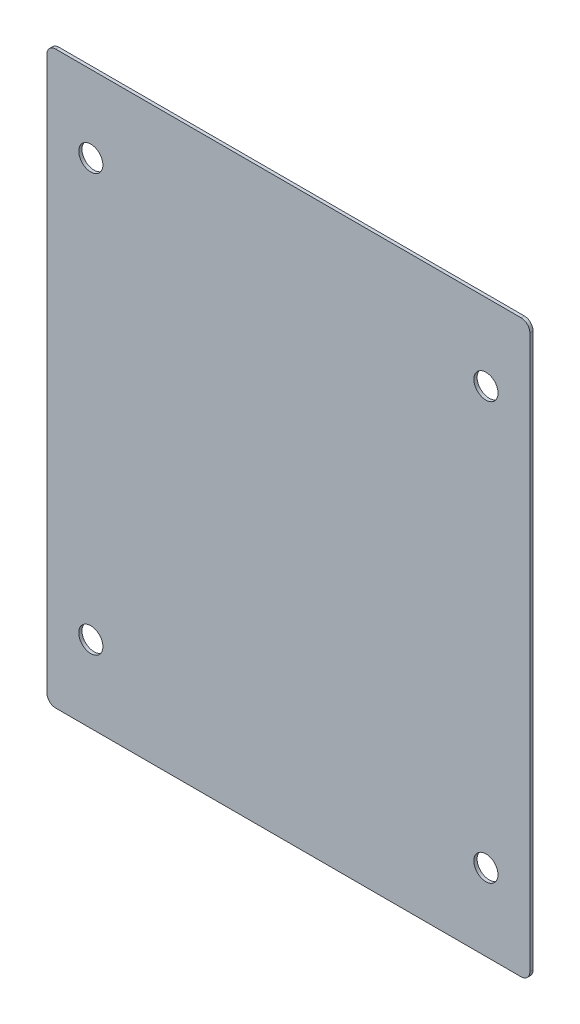
ISO-10303-21;
HEADER;
FILE_DESCRIPTION(('STEP AP214'),'2;1');
FILE_NAME('part.step','',(''),(''),'','','');
FILE_SCHEMA(('AUTOMOTIVE_DESIGN { 1 0 10303 214 1 1 1 1 }'));
ENDSEC;
DATA;
#1=APPLICATION_CONTEXT('core data for automotive mechanical design processes');
#2=APPLICATION_PROTOCOL_DEFINITION('international standard','automotive_design',2000,#1);
#3=PRODUCT_CONTEXT('',#1,'mechanical');
#4=PRODUCT('Part','Part','',(#3));
#5=PRODUCT_RELATED_PRODUCT_CATEGORY('part','',(#4));
#6=PRODUCT_DEFINITION_FORMATION('','',#4);
#7=PRODUCT_DEFINITION_CONTEXT('part definition',#1,'design');
#8=PRODUCT_DEFINITION('design','',#6,#7);
#9=PRODUCT_DEFINITION_SHAPE('','',#8);
#10=(LENGTH_UNIT() NAMED_UNIT(*) SI_UNIT(.MILLI.,.METRE.));
#11=(NAMED_UNIT(*) PLANE_ANGLE_UNIT() SI_UNIT($,.RADIAN.));
#12=(NAMED_UNIT(*) SI_UNIT($,.STERADIAN.) SOLID_ANGLE_UNIT());
#13=UNCERTAINTY_MEASURE_WITH_UNIT(LENGTH_MEASURE(1.E-05),#10,'distance_accuracy_value','');
#14=(GEOMETRIC_REPRESENTATION_CONTEXT(3) GLOBAL_UNCERTAINTY_ASSIGNED_CONTEXT((#13)) GLOBAL_UNIT_ASSIGNED_CONTEXT((#10,
#11,#12)) REPRESENTATION_CONTEXT('',''));
#15=CARTESIAN_POINT('',(0.,0.,0.));
#16=DIRECTION('',(0.,0.,1.));
#17=DIRECTION('',(1.,0.,0.));
#18=AXIS2_PLACEMENT_3D('',#15,#16,#17);
#19=CARTESIAN_POINT('',(-55.,-65.,-0.7366));
#20=DIRECTION('',(-1.,0.,0.));
#21=DIRECTION('',(0.,0.,1.));
#22=AXIS2_PLACEMENT_3D('',#19,#20,#21);
#23=PLANE('',#22);
#24=DIRECTION('',(0.,-1.,0.));
#25=VECTOR('',#24,1.);
#26=CARTESIAN_POINT('',(-55.,-65.,-0.7366));
#27=LINE('',#26,#25);
#28=CARTESIAN_POINT('',(-55.,63.,-0.7366));
#29=VERTEX_POINT('',#28);
#30=CARTESIAN_POINT('',(-55.,-63.,-0.7366));
#31=VERTEX_POINT('',#30);
#32=EDGE_CURVE('E161',#29,#31,#27,.T.);
#33=ORIENTED_EDGE('',*,*,#32,.T.);
#34=DIRECTION('',(0.,0.,1.));
#35=VECTOR('',#34,1.);
#36=CARTESIAN_POINT('',(-55.,-63.,-0.7366));
#37=LINE('',#36,#35);
#38=CARTESIAN_POINT('',(-55.,-63.,0.));
#39=VERTEX_POINT('',#38);
#40=EDGE_CURVE('E154',#31,#39,#37,.T.);
#41=ORIENTED_EDGE('',*,*,#40,.T.);
#42=DIRECTION('',(0.,-1.,0.));
#43=VECTOR('',#42,1.);
#44=CARTESIAN_POINT('',(-55.,-65.,0.));
#45=LINE('',#44,#43);
#46=CARTESIAN_POINT('',(-55.,63.,0.));
#47=VERTEX_POINT('',#46);
#48=EDGE_CURVE('E107',#47,#39,#45,.T.);
#49=ORIENTED_EDGE('',*,*,#48,.F.);
#50=DIRECTION('',(0.,0.,1.));
#51=VECTOR('',#50,1.);
#52=CARTESIAN_POINT('',(-55.,63.,-0.7366));
#53=LINE('',#52,#51);
#54=EDGE_CURVE('E152',#47,#29,#53,.F.);
#55=ORIENTED_EDGE('',*,*,#54,.T.);
#56=EDGE_LOOP('',(#33,#41,#49,#55));
#57=FACE_BOUND('',#56,.T.);
#58=ADVANCED_FACE('F37',(#57),#23,.T.);
#59=CARTESIAN_POINT('',(55.,65.,-0.7366));
#60=DIRECTION('',(0.,1.,0.));
#61=DIRECTION('',(-1.,0.,0.));
#62=AXIS2_PLACEMENT_3D('',#59,#60,#61);
#63=PLANE('',#62);
#64=DIRECTION('',(-1.,0.,0.));
#65=VECTOR('',#64,1.);
#66=CARTESIAN_POINT('',(55.,65.,0.));
#67=LINE('',#66,#65);
#68=CARTESIAN_POINT('',(53.,65.,0.));
#69=VERTEX_POINT('',#68);
#70=CARTESIAN_POINT('',(-53.,65.,0.));
#71=VERTEX_POINT('',#70);
#72=EDGE_CURVE('E135',#69,#71,#67,.T.);
#73=ORIENTED_EDGE('',*,*,#72,.F.);
#74=DIRECTION('',(0.,0.,1.));
#75=VECTOR('',#74,1.);
#76=CARTESIAN_POINT('',(53.,65.,-0.7366));
#77=LINE('',#76,#75);
#78=CARTESIAN_POINT('',(53.,65.,-0.7366));
#79=VERTEX_POINT('',#78);
#80=EDGE_CURVE('E11',#69,#79,#77,.F.);
#81=ORIENTED_EDGE('',*,*,#80,.T.);
#82=DIRECTION('',(-1.,0.,0.));
#83=VECTOR('',#82,1.);
#84=CARTESIAN_POINT('',(55.,65.,-0.7366));
#85=LINE('',#84,#83);
#86=CARTESIAN_POINT('',(-53.,65.,-0.7366));
#87=VERTEX_POINT('',#86);
#88=EDGE_CURVE('E128',#79,#87,#85,.T.);
#89=ORIENTED_EDGE('',*,*,#88,.T.);
#90=DIRECTION('',(0.,0.,1.));
#91=VECTOR('',#90,1.);
#92=CARTESIAN_POINT('',(-53.,65.,-0.7366));
#93=LINE('',#92,#91);
#94=EDGE_CURVE('E45',#87,#71,#93,.T.);
#95=ORIENTED_EDGE('',*,*,#94,.T.);
#96=EDGE_LOOP('',(#73,#81,#89,#95));
#97=FACE_BOUND('',#96,.T.);
#98=ADVANCED_FACE('F158',(#97),#63,.T.);
#99=CARTESIAN_POINT('',(55.,-65.,-0.7366));
#100=DIRECTION('',(1.,0.,0.));
#101=DIRECTION('',(0.,0.,-1.));
#102=AXIS2_PLACEMENT_3D('',#99,#100,#101);
#103=PLANE('',#102);
#104=DIRECTION('',(0.,1.,0.));
#105=VECTOR('',#104,1.);
#106=CARTESIAN_POINT('',(55.,-65.,0.));
#107=LINE('',#106,#105);
#108=CARTESIAN_POINT('',(55.,-63.,0.));
#109=VERTEX_POINT('',#108);
#110=CARTESIAN_POINT('',(55.,63.,0.));
#111=VERTEX_POINT('',#110);
#112=EDGE_CURVE('E123',#109,#111,#107,.T.);
#113=ORIENTED_EDGE('',*,*,#112,.F.);
#114=DIRECTION('',(0.,0.,1.));
#115=VECTOR('',#114,1.);
#116=CARTESIAN_POINT('',(55.,-63.,-0.7366));
#117=LINE('',#116,#115);
#118=CARTESIAN_POINT('',(55.,-63.,-0.7366));
#119=VERTEX_POINT('',#118);
#120=EDGE_CURVE('E144',#109,#119,#117,.F.);
#121=ORIENTED_EDGE('',*,*,#120,.T.);
#122=DIRECTION('',(0.,1.,0.));
#123=VECTOR('',#122,1.);
#124=CARTESIAN_POINT('',(55.,-65.,-0.7366));
#125=LINE('',#124,#123);
#126=CARTESIAN_POINT('',(55.,63.,-0.7366));
#127=VERTEX_POINT('',#126);
#128=EDGE_CURVE('E132',#119,#127,#125,.T.);
#129=ORIENTED_EDGE('',*,*,#128,.T.);
#130=DIRECTION('',(0.,0.,1.));
#131=VECTOR('',#130,1.);
#132=CARTESIAN_POINT('',(55.,63.,-0.7366));
#133=LINE('',#132,#131);
#134=EDGE_CURVE('E141',#127,#111,#133,.T.);
#135=ORIENTED_EDGE('',*,*,#134,.T.);
#136=EDGE_LOOP('',(#113,#121,#129,#135));
#137=FACE_BOUND('',#136,.T.);
#138=ADVANCED_FACE('F227',(#137),#103,.T.);
#139=CARTESIAN_POINT('',(55.,-65.,-0.7366));
#140=DIRECTION('',(0.,-1.,0.));
#141=DIRECTION('',(1.,0.,0.));
#142=AXIS2_PLACEMENT_3D('',#139,#140,#141);
#143=PLANE('',#142);
#144=DIRECTION('',(1.,0.,0.));
#145=VECTOR('',#144,1.);
#146=CARTESIAN_POINT('',(55.,-65.,-0.7366));
#147=LINE('',#146,#145);
#148=CARTESIAN_POINT('',(-53.,-65.,-0.7366));
#149=VERTEX_POINT('',#148);
#150=CARTESIAN_POINT('',(53.,-65.,-0.7366));
#151=VERTEX_POINT('',#150);
#152=EDGE_CURVE('E163',#149,#151,#147,.T.);
#153=ORIENTED_EDGE('',*,*,#152,.T.);
#154=DIRECTION('',(0.,0.,1.));
#155=VECTOR('',#154,1.);
#156=CARTESIAN_POINT('',(53.,-65.,-0.7366));
#157=LINE('',#156,#155);
#158=CARTESIAN_POINT('',(53.,-65.,0.));
#159=VERTEX_POINT('',#158);
#160=EDGE_CURVE('E122',#151,#159,#157,.T.);
#161=ORIENTED_EDGE('',*,*,#160,.T.);
#162=DIRECTION('',(1.,0.,0.));
#163=VECTOR('',#162,1.);
#164=CARTESIAN_POINT('',(55.,-65.,0.));
#165=LINE('',#164,#163);
#166=CARTESIAN_POINT('',(-53.,-65.,0.));
#167=VERTEX_POINT('',#166);
#168=EDGE_CURVE('E105',#167,#159,#165,.T.);
#169=ORIENTED_EDGE('',*,*,#168,.F.);
#170=DIRECTION('',(0.,0.,1.));
#171=VECTOR('',#170,1.);
#172=CARTESIAN_POINT('',(-53.,-65.,-0.7366));
#173=LINE('',#172,#171);
#174=EDGE_CURVE('E119',#167,#149,#173,.F.);
#175=ORIENTED_EDGE('',*,*,#174,.T.);
#176=EDGE_LOOP('',(#153,#161,#169,#175));
#177=FACE_BOUND('',#176,.T.);
#178=ADVANCED_FACE('F118',(#177),#143,.T.);
#179=CARTESIAN_POINT('',(0.,0.,-0.7366));
#180=DIRECTION('',(0.,0.,1.));
#181=DIRECTION('',(1.,0.,0.));
#182=AXIS2_PLACEMENT_3D('',#179,#180,#181);
#183=PLANE('',#182);
#184=CARTESIAN_POINT('',(-45.,47.5,-0.7366));
#185=DIRECTION('',(0.,0.,1.));
#186=DIRECTION('',(1.,0.,0.));
#187=AXIS2_PLACEMENT_3D('',#184,#185,#186);
#188=CIRCLE('',#187,2.75);
#189=CARTESIAN_POINT('',(-42.25,47.5,-0.7366));
#190=VERTEX_POINT('',#189);
#191=EDGE_CURVE('E189',#190,#190,#188,.T.);
#192=ORIENTED_EDGE('',*,*,#191,.T.);
#193=EDGE_LOOP('',(#192));
#194=FACE_BOUND('',#193,.T.);
#195=CARTESIAN_POINT('',(45.,47.5,-0.7366));
#196=DIRECTION('',(0.,0.,1.));
#197=DIRECTION('',(1.,0.,0.));
#198=AXIS2_PLACEMENT_3D('',#195,#196,#197);
#199=CIRCLE('',#198,2.75);
#200=CARTESIAN_POINT('',(47.75,47.5,-0.7366));
#201=VERTEX_POINT('',#200);
#202=EDGE_CURVE('E183',#201,#201,#199,.T.);
#203=ORIENTED_EDGE('',*,*,#202,.T.);
#204=EDGE_LOOP('',(#203));
#205=FACE_BOUND('',#204,.T.);
#206=CARTESIAN_POINT('',(45.,-47.5,-0.7366));
#207=DIRECTION('',(0.,0.,1.));
#208=DIRECTION('',(1.,0.,0.));
#209=AXIS2_PLACEMENT_3D('',#206,#207,#208);
#210=CIRCLE('',#209,2.75);
#211=CARTESIAN_POINT('',(47.75,-47.5,-0.7366));
#212=VERTEX_POINT('',#211);
#213=EDGE_CURVE('E177',#212,#212,#210,.T.);
#214=ORIENTED_EDGE('',*,*,#213,.T.);
#215=EDGE_LOOP('',(#214));
#216=FACE_BOUND('',#215,.T.);
#217=CARTESIAN_POINT('',(-45.,-47.5,-0.7366));
#218=DIRECTION('',(0.,0.,1.));
#219=DIRECTION('',(1.,0.,0.));
#220=AXIS2_PLACEMENT_3D('',#217,#218,#219);
#221=CIRCLE('',#220,2.75);
#222=CARTESIAN_POINT('',(-42.25,-47.5,-0.7366));
#223=VERTEX_POINT('',#222);
#224=EDGE_CURVE('E167',#223,#223,#221,.T.);
#225=ORIENTED_EDGE('',*,*,#224,.T.);
#226=EDGE_LOOP('',(#225));
#227=FACE_BOUND('',#226,.T.);
#228=ORIENTED_EDGE('',*,*,#128,.F.);
#229=CARTESIAN_POINT('',(53.,-63.,-0.7366));
#230=DIRECTION('',(0.,0.,1.));
#231=DIRECTION('',(1.,0.,0.));
#232=AXIS2_PLACEMENT_3D('',#229,#230,#231);
#233=CIRCLE('',#232,2.);
#234=EDGE_CURVE('E150',#119,#151,#233,.F.);
#235=ORIENTED_EDGE('',*,*,#234,.T.);
#236=ORIENTED_EDGE('',*,*,#152,.F.);
#237=CARTESIAN_POINT('',(-53.,-63.,-0.7366));
#238=DIRECTION('',(0.,0.,1.));
#239=DIRECTION('',(1.,0.,0.));
#240=AXIS2_PLACEMENT_3D('',#237,#238,#239);
#241=CIRCLE('',#240,2.);
#242=EDGE_CURVE('E127',#149,#31,#241,.F.);
#243=ORIENTED_EDGE('',*,*,#242,.T.);
#244=ORIENTED_EDGE('',*,*,#32,.F.);
#245=CARTESIAN_POINT('',(-53.,63.,-0.7366));
#246=DIRECTION('',(0.,0.,1.));
#247=DIRECTION('',(1.,0.,0.));
#248=AXIS2_PLACEMENT_3D('',#245,#246,#247);
#249=CIRCLE('',#248,2.);
#250=EDGE_CURVE('E52',#29,#87,#249,.F.);
#251=ORIENTED_EDGE('',*,*,#250,.T.);
#252=ORIENTED_EDGE('',*,*,#88,.F.);
#253=CARTESIAN_POINT('',(53.,63.,-0.7366));
#254=DIRECTION('',(0.,0.,1.));
#255=DIRECTION('',(1.,0.,0.));
#256=AXIS2_PLACEMENT_3D('',#253,#254,#255);
#257=CIRCLE('',#256,2.);
#258=EDGE_CURVE('E147',#79,#127,#257,.F.);
#259=ORIENTED_EDGE('',*,*,#258,.T.);
#260=EDGE_LOOP('',(#228,#235,#236,#243,#244,#251,#252,#259));
#261=FACE_BOUND('',#260,.T.);
#262=ADVANCED_FACE('F201',(#194,#205,#216,#227,#261),#183,.F.);
#263=CARTESIAN_POINT('',(0.,0.,0.));
#264=DIRECTION('',(0.,0.,1.));
#265=DIRECTION('',(1.,0.,0.));
#266=AXIS2_PLACEMENT_3D('',#263,#264,#265);
#267=PLANE('',#266);
#268=CARTESIAN_POINT('',(-45.,47.5,0.));
#269=DIRECTION('',(0.,0.,1.));
#270=DIRECTION('',(1.,0.,0.));
#271=AXIS2_PLACEMENT_3D('',#268,#269,#270);
#272=CIRCLE('',#271,2.74999999999999);
#273=CARTESIAN_POINT('',(-42.25,47.5,0.));
#274=VERTEX_POINT('',#273);
#275=EDGE_CURVE('E192',#274,#274,#272,.T.);
#276=ORIENTED_EDGE('',*,*,#275,.F.);
#277=EDGE_LOOP('',(#276));
#278=FACE_BOUND('',#277,.T.);
#279=CARTESIAN_POINT('',(45.,47.5,0.));
#280=DIRECTION('',(0.,0.,1.));
#281=DIRECTION('',(1.,0.,0.));
#282=AXIS2_PLACEMENT_3D('',#279,#280,#281);
#283=CIRCLE('',#282,2.74999999999999);
#284=CARTESIAN_POINT('',(47.75,47.5,0.));
#285=VERTEX_POINT('',#284);
#286=EDGE_CURVE('E186',#285,#285,#283,.T.);
#287=ORIENTED_EDGE('',*,*,#286,.F.);
#288=EDGE_LOOP('',(#287));
#289=FACE_BOUND('',#288,.T.);
#290=CARTESIAN_POINT('',(45.,-47.5,0.));
#291=DIRECTION('',(0.,0.,1.));
#292=DIRECTION('',(1.,0.,0.));
#293=AXIS2_PLACEMENT_3D('',#290,#291,#292);
#294=CIRCLE('',#293,2.74999999999999);
#295=CARTESIAN_POINT('',(47.75,-47.5,0.));
#296=VERTEX_POINT('',#295);
#297=EDGE_CURVE('E180',#296,#296,#294,.T.);
#298=ORIENTED_EDGE('',*,*,#297,.F.);
#299=EDGE_LOOP('',(#298));
#300=FACE_BOUND('',#299,.T.);
#301=CARTESIAN_POINT('',(-45.,-47.5,0.));
#302=DIRECTION('',(0.,0.,1.));
#303=DIRECTION('',(1.,0.,0.));
#304=AXIS2_PLACEMENT_3D('',#301,#302,#303);
#305=CIRCLE('',#304,2.74999999999999);
#306=CARTESIAN_POINT('',(-42.25,-47.5,0.));
#307=VERTEX_POINT('',#306);
#308=EDGE_CURVE('E174',#307,#307,#305,.T.);
#309=ORIENTED_EDGE('',*,*,#308,.F.);
#310=EDGE_LOOP('',(#309));
#311=FACE_BOUND('',#310,.T.);
#312=ORIENTED_EDGE('',*,*,#168,.T.);
#313=CARTESIAN_POINT('',(53.,-63.,0.));
#314=DIRECTION('',(0.,0.,1.));
#315=DIRECTION('',(1.,0.,0.));
#316=AXIS2_PLACEMENT_3D('',#313,#314,#315);
#317=CIRCLE('',#316,2.);
#318=EDGE_CURVE('E112',#159,#109,#317,.T.);
#319=ORIENTED_EDGE('',*,*,#318,.T.);
#320=ORIENTED_EDGE('',*,*,#112,.T.);
#321=CARTESIAN_POINT('',(53.,63.,0.));
#322=DIRECTION('',(0.,0.,1.));
#323=DIRECTION('',(1.,0.,0.));
#324=AXIS2_PLACEMENT_3D('',#321,#322,#323);
#325=CIRCLE('',#324,2.);
#326=EDGE_CURVE('E113',#111,#69,#325,.T.);
#327=ORIENTED_EDGE('',*,*,#326,.T.);
#328=ORIENTED_EDGE('',*,*,#72,.T.);
#329=CARTESIAN_POINT('',(-53.,63.,0.));
#330=DIRECTION('',(0.,0.,1.));
#331=DIRECTION('',(1.,0.,0.));
#332=AXIS2_PLACEMENT_3D('',#329,#330,#331);
#333=CIRCLE('',#332,2.);
#334=EDGE_CURVE('E130',#71,#47,#333,.T.);
#335=ORIENTED_EDGE('',*,*,#334,.T.);
#336=ORIENTED_EDGE('',*,*,#48,.T.);
#337=CARTESIAN_POINT('',(-53.,-63.,0.));
#338=DIRECTION('',(0.,0.,1.));
#339=DIRECTION('',(1.,0.,0.));
#340=AXIS2_PLACEMENT_3D('',#337,#338,#339);
#341=CIRCLE('',#340,2.);
#342=EDGE_CURVE('E102',#39,#167,#341,.T.);
#343=ORIENTED_EDGE('',*,*,#342,.T.);
#344=EDGE_LOOP('',(#312,#319,#320,#327,#328,#335,#336,#343));
#345=FACE_BOUND('',#344,.T.);
#346=ADVANCED_FACE('F104',(#278,#289,#300,#311,#345),#267,.T.);
#347=CARTESIAN_POINT('',(-45.,-47.5,0.));
#348=DIRECTION('',(0.,0.,1.));
#349=DIRECTION('',(1.,0.,0.));
#350=AXIS2_PLACEMENT_3D('',#347,#348,#349);
#351=CYLINDRICAL_SURFACE('',#350,2.75);
#352=ORIENTED_EDGE('',*,*,#224,.F.);
#353=EDGE_LOOP('',(#352));
#354=FACE_BOUND('',#353,.T.);
#355=ORIENTED_EDGE('',*,*,#308,.T.);
#356=EDGE_LOOP('',(#355));
#357=FACE_BOUND('',#356,.T.);
#358=ADVANCED_FACE('F200',(#354,#357),#351,.F.);
#359=CARTESIAN_POINT('',(45.,-47.5,0.));
#360=DIRECTION('',(0.,0.,1.));
#361=DIRECTION('',(1.,0.,0.));
#362=AXIS2_PLACEMENT_3D('',#359,#360,#361);
#363=CYLINDRICAL_SURFACE('',#362,2.75);
#364=ORIENTED_EDGE('',*,*,#213,.F.);
#365=EDGE_LOOP('',(#364));
#366=FACE_BOUND('',#365,.T.);
#367=ORIENTED_EDGE('',*,*,#297,.T.);
#368=EDGE_LOOP('',(#367));
#369=FACE_BOUND('',#368,.T.);
#370=ADVANCED_FACE('F210',(#366,#369),#363,.F.);
#371=CARTESIAN_POINT('',(45.,47.5,0.));
#372=DIRECTION('',(0.,0.,1.));
#373=DIRECTION('',(1.,0.,0.));
#374=AXIS2_PLACEMENT_3D('',#371,#372,#373);
#375=CYLINDRICAL_SURFACE('',#374,2.75);
#376=ORIENTED_EDGE('',*,*,#202,.F.);
#377=EDGE_LOOP('',(#376));
#378=FACE_BOUND('',#377,.T.);
#379=ORIENTED_EDGE('',*,*,#286,.T.);
#380=EDGE_LOOP('',(#379));
#381=FACE_BOUND('',#380,.T.);
#382=ADVANCED_FACE('F216',(#378,#381),#375,.F.);
#383=CARTESIAN_POINT('',(-45.,47.5,0.));
#384=DIRECTION('',(0.,0.,1.));
#385=DIRECTION('',(1.,0.,0.));
#386=AXIS2_PLACEMENT_3D('',#383,#384,#385);
#387=CYLINDRICAL_SURFACE('',#386,2.75);
#388=ORIENTED_EDGE('',*,*,#191,.F.);
#389=EDGE_LOOP('',(#388));
#390=FACE_BOUND('',#389,.T.);
#391=ORIENTED_EDGE('',*,*,#275,.T.);
#392=EDGE_LOOP('',(#391));
#393=FACE_BOUND('',#392,.T.);
#394=ADVANCED_FACE('F196',(#390,#393),#387,.F.);
#395=CARTESIAN_POINT('',(53.,-63.,-0.7366));
#396=DIRECTION('',(0.,0.,1.));
#397=DIRECTION('',(1.,0.,0.));
#398=AXIS2_PLACEMENT_3D('',#395,#396,#397);
#399=CYLINDRICAL_SURFACE('',#398,2.);
#400=ORIENTED_EDGE('',*,*,#234,.F.);
#401=ORIENTED_EDGE('',*,*,#120,.F.);
#402=ORIENTED_EDGE('',*,*,#318,.F.);
#403=ORIENTED_EDGE('',*,*,#160,.F.);
#404=EDGE_LOOP('',(#400,#401,#402,#403));
#405=FACE_BOUND('',#404,.T.);
#406=ADVANCED_FACE('F232',(#405),#399,.T.);
#407=CARTESIAN_POINT('',(-53.,-63.,-0.7366));
#408=DIRECTION('',(0.,0.,1.));
#409=DIRECTION('',(1.,0.,0.));
#410=AXIS2_PLACEMENT_3D('',#407,#408,#409);
#411=CYLINDRICAL_SURFACE('',#410,2.);
#412=ORIENTED_EDGE('',*,*,#242,.F.);
#413=ORIENTED_EDGE('',*,*,#174,.F.);
#414=ORIENTED_EDGE('',*,*,#342,.F.);
#415=ORIENTED_EDGE('',*,*,#40,.F.);
#416=EDGE_LOOP('',(#412,#413,#414,#415));
#417=FACE_BOUND('',#416,.T.);
#418=ADVANCED_FACE('F126',(#417),#411,.T.);
#419=CARTESIAN_POINT('',(53.,63.,-0.7366));
#420=DIRECTION('',(0.,0.,1.));
#421=DIRECTION('',(1.,0.,0.));
#422=AXIS2_PLACEMENT_3D('',#419,#420,#421);
#423=CYLINDRICAL_SURFACE('',#422,2.);
#424=ORIENTED_EDGE('',*,*,#258,.F.);
#425=ORIENTED_EDGE('',*,*,#80,.F.);
#426=ORIENTED_EDGE('',*,*,#326,.F.);
#427=ORIENTED_EDGE('',*,*,#134,.F.);
#428=EDGE_LOOP('',(#424,#425,#426,#427));
#429=FACE_BOUND('',#428,.T.);
#430=ADVANCED_FACE('F237',(#429),#423,.T.);
#431=CARTESIAN_POINT('',(-53.,63.,-0.7366));
#432=DIRECTION('',(0.,0.,1.));
#433=DIRECTION('',(1.,0.,0.));
#434=AXIS2_PLACEMENT_3D('',#431,#432,#433);
#435=CYLINDRICAL_SURFACE('',#434,2.);
#436=ORIENTED_EDGE('',*,*,#250,.F.);
#437=ORIENTED_EDGE('',*,*,#54,.F.);
#438=ORIENTED_EDGE('',*,*,#334,.F.);
#439=ORIENTED_EDGE('',*,*,#94,.F.);
#440=EDGE_LOOP('',(#436,#437,#438,#439));
#441=FACE_BOUND('',#440,.T.);
#442=ADVANCED_FACE('F39',(#441),#435,.T.);
#443=CLOSED_SHELL('',(#58,#98,#138,#178,#262,#346,#358,#370,#382,#394,#406,#418,#430,#442));
#444=MANIFOLD_SOLID_BREP('B2',#443);
#445=ADVANCED_BREP_SHAPE_REPRESENTATION('',(#18,#444),#14);
#446=SHAPE_DEFINITION_REPRESENTATION(#9,#445);
ENDSEC;
END-ISO-10303-21;
